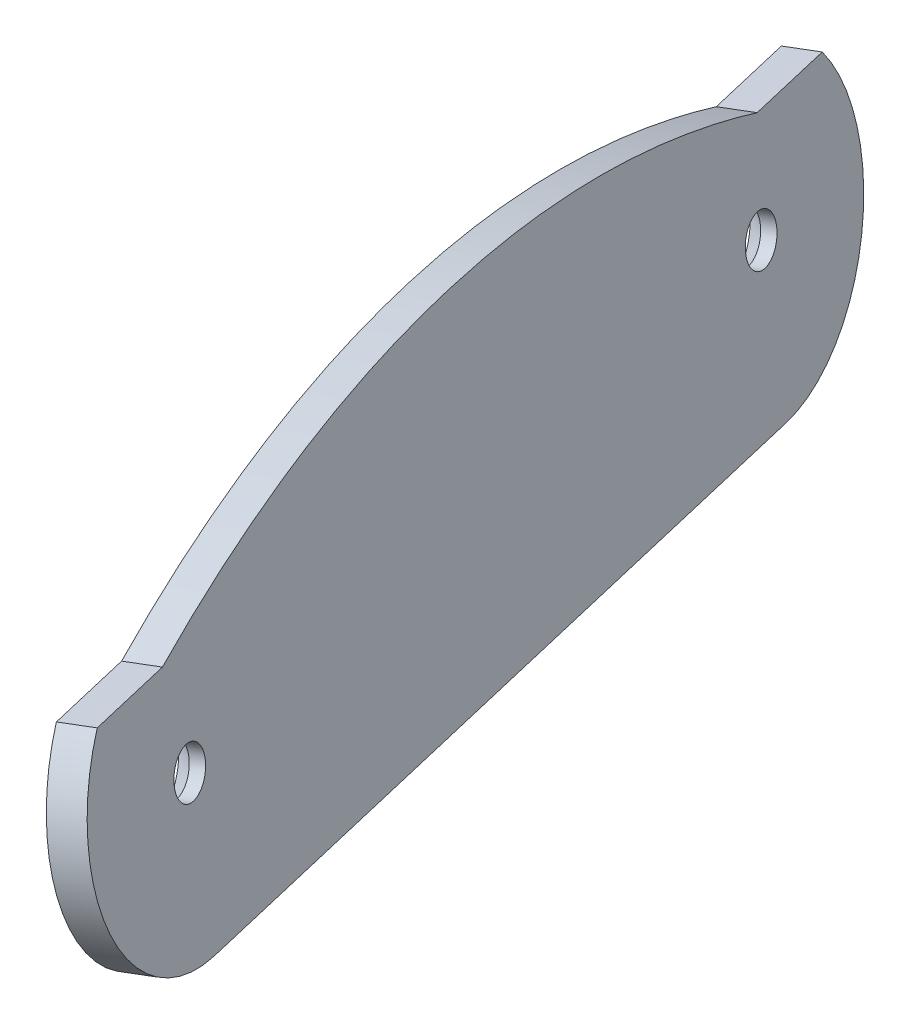
ISO-10303-21;
HEADER;
FILE_DESCRIPTION(('STEP AP214'),'2;1');
FILE_NAME('part.step','',(''),(''),'','','');
FILE_SCHEMA(('AUTOMOTIVE_DESIGN { 1 0 10303 214 1 1 1 1 }'));
ENDSEC;
DATA;
#1=APPLICATION_CONTEXT('core data for automotive mechanical design processes');
#2=APPLICATION_PROTOCOL_DEFINITION('international standard','automotive_design',2000,#1);
#3=PRODUCT_CONTEXT('',#1,'mechanical');
#4=PRODUCT('Part','Part','',(#3));
#5=PRODUCT_RELATED_PRODUCT_CATEGORY('part','',(#4));
#6=PRODUCT_DEFINITION_FORMATION('','',#4);
#7=PRODUCT_DEFINITION_CONTEXT('part definition',#1,'design');
#8=PRODUCT_DEFINITION('design','',#6,#7);
#9=PRODUCT_DEFINITION_SHAPE('','',#8);
#10=(LENGTH_UNIT() NAMED_UNIT(*) SI_UNIT(.MILLI.,.METRE.));
#11=(NAMED_UNIT(*) PLANE_ANGLE_UNIT() SI_UNIT($,.RADIAN.));
#12=(NAMED_UNIT(*) SI_UNIT($,.STERADIAN.) SOLID_ANGLE_UNIT());
#13=UNCERTAINTY_MEASURE_WITH_UNIT(LENGTH_MEASURE(1.E-05),#10,'distance_accuracy_value','');
#14=(GEOMETRIC_REPRESENTATION_CONTEXT(3) GLOBAL_UNCERTAINTY_ASSIGNED_CONTEXT((#13)) GLOBAL_UNIT_ASSIGNED_CONTEXT((#10,
#11,#12)) REPRESENTATION_CONTEXT('',''));
#15=CARTESIAN_POINT('',(0.,0.,0.));
#16=DIRECTION('',(0.,0.,1.));
#17=DIRECTION('',(1.,0.,0.));
#18=AXIS2_PLACEMENT_3D('',#15,#16,#17);
#19=CARTESIAN_POINT('',(-40.11295222287,17.0186543610889,-28.3343367908795));
#20=DIRECTION('',(-0.94260125672026,-0.173023358316314,0.285597248422197));
#21=DIRECTION('',(0.289970666872155,0.,0.957035533485418));
#22=AXIS2_PLACEMENT_3D('',#19,#20,#21);
#23=PLANE('',#22);
#24=CARTESIAN_POINT('',(-40.11295222287,17.0186543610889,-28.3343367908795));
#25=DIRECTION('',(0.94260125672026,0.173023358316314,-0.285597248422197));
#26=DIRECTION('',(-0.289970666872155,0.,-0.957035533485418));
#27=AXIS2_PLACEMENT_3D('',#24,#25,#26);
#28=CIRCLE('',#27,1.7);
#29=CARTESIAN_POINT('',(-40.6059023565526,17.0186543610889,-29.9612971978047));
#30=VERTEX_POINT('',#29);
#31=EDGE_CURVE('E241',#30,#30,#28,.F.);
#32=ORIENTED_EDGE('',*,*,#31,.T.);
#33=EDGE_LOOP('',(#32));
#34=FACE_BOUND('',#33,.T.);
#35=CARTESIAN_POINT('',(-22.579475875422,21.3484057293149,32.1572297687716));
#36=DIRECTION('',(0.94260125672026,0.173023358316314,-0.285597248422197));
#37=DIRECTION('',(-0.289970666872155,0.,-0.957035533485418));
#38=AXIS2_PLACEMENT_3D('',#35,#36,#37);
#39=CIRCLE('',#38,1.69999999999999);
#40=CARTESIAN_POINT('',(-23.0724260091046,21.3484057293149,30.5302693618464));
#41=VERTEX_POINT('',#40);
#42=EDGE_CURVE('E243',#41,#41,#39,.F.);
#43=ORIENTED_EDGE('',*,*,#42,.T.);
#44=EDGE_LOOP('',(#43));
#45=FACE_BOUND('',#44,.T.);
#46=CARTESIAN_POINT('',(-40.11295222287,17.0186543610889,-28.3343367908795));
#47=DIRECTION('',(-0.94260125672026,-0.173023358316314,0.285597248422197));
#48=DIRECTION('',(0.289970666872155,0.,0.957035533485418));
#49=AXIS2_PLACEMENT_3D('',#46,#47,#48);
#50=CIRCLE('',#49,11.0000000000005);
#51=CARTESIAN_POINT('',(-43.7672773970329,23.3143822759067,-36.5811372337226));
#52=VERTEX_POINT('',#51);
#53=CARTESIAN_POINT('',(-38.0737763440546,6.21085873277291,-28.1518117465194));
#54=VERTEX_POINT('',#53);
#55=EDGE_CURVE('E270',#52,#54,#50,.T.);
#56=ORIENTED_EDGE('',*,*,#55,.F.);
#57=DIRECTION('',(0.277735963345848,0.0685846687486946,0.958206072761484));
#58=VECTOR('',#57,1.);
#59=CARTESIAN_POINT('',(-32.6530255436484,26.0589576365155,1.76371192379228));
#60=LINE('',#59,#58);
#61=CARTESIAN_POINT('',(-41.7694932215581,23.8077190561194,-29.6886595511607));
#62=VERTEX_POINT('',#61);
#63=EDGE_CURVE('E135',#52,#62,#60,.T.);
#64=ORIENTED_EDGE('',*,*,#63,.T.);
#65=CARTESIAN_POINT('',(-23.0895950964223,27.9372593706154,34.4653282162256));
#66=CARTESIAN_POINT('',(-24.0435126727006,28.7861376137802,31.8312407173805));
#67=CARTESIAN_POINT('',(-25.9355283404896,30.2324582557961,26.4629498813215));
#68=CARTESIAN_POINT('',(-28.6732328036035,31.6082977859542,18.2608005105246));
#69=CARTESIAN_POINT('',(-31.2822930092692,32.1961759754505,10.0058653417986));
#70=CARTESIAN_POINT('',(-33.7685748223319,32.0018546785873,1.68227504790652));
#71=CARTESIAN_POINT('',(-36.1395781293714,31.0013702807458,-6.74924129429978));
#72=CARTESIAN_POINT('',(-38.3095526646606,29.2188320689078,-14.9910625469831));
#73=CARTESIAN_POINT('',(-40.2832311301018,26.687493899873,-23.0386626048435));
#74=CARTESIAN_POINT('',(-41.4733406747353,24.4748431444816,-28.3070572591958));
#75=CARTESIAN_POINT('',(-42.0290972035189,23.2502622065628,-30.8831952049758));
#76=B_SPLINE_CURVE_WITH_KNOTS('',3,(#65,#66,#67,#68,#69,#70,#71,#72,#73,#74,#75),.UNSPECIFIED.,
.F.,.F.,(4,1,1,1,1,1,1,1,4),(0.00843363175947347,0.131411631961573,0.254389632163673,
0.377367632365774,0.500345632567874,0.623323632769974,0.746301632972074,0.869279633174174,
0.992257633376274),.UNSPECIFIED.);
#77=CARTESIAN_POINT('',(-23.5218965035317,28.313816722725,33.2666659957263));
#78=VERTEX_POINT('',#77);
#79=EDGE_CURVE('E284',#78,#62,#76,.T.);
#80=ORIENTED_EDGE('',*,*,#79,.F.);
#81=DIRECTION('',(0.277735963345827,0.0685846687488062,0.958206072761482));
#82=VECTOR('',#81,1.);
#83=CARTESIAN_POINT('',(-23.5218965035314,28.3138167227251,33.2666659957262));
#84=LINE('',#83,#82);
#85=CARTESIAN_POINT('',(-21.5204654561153,28.8080540687172,40.1717256097006));
#86=VERTEX_POINT('',#85);
#87=EDGE_CURVE('E130',#78,#86,#84,.T.);
#88=ORIENTED_EDGE('',*,*,#87,.T.);
#89=CARTESIAN_POINT('',(-22.579475875422,21.3484057293149,32.1572297687716));
#90=DIRECTION('',(0.94260125672026,0.173023358316314,-0.285597248422197));
#91=DIRECTION('',(-0.289970666872155,0.,-0.957035533485418));
#92=AXIS2_PLACEMENT_3D('',#89,#90,#91);
#93=CIRCLE('',#92,11.0000000000006);
#94=CARTESIAN_POINT('',(-20.5402999966066,10.5406101009986,32.3397548131317));
#95=VERTEX_POINT('',#94);
#96=EDGE_CURVE('E277',#86,#95,#93,.T.);
#97=ORIENTED_EDGE('',*,*,#96,.T.);
#98=DIRECTION('',(0.277735963345854,0.0685846687486638,0.958206072761484));
#99=VECTOR('',#98,1.);
#100=CARTESIAN_POINT('',(-38.0737763440546,6.21085873277291,-28.1518117465194));
#101=LINE('',#100,#99);
#102=EDGE_CURVE('E273',#54,#95,#101,.T.);
#103=ORIENTED_EDGE('',*,*,#102,.F.);
#104=EDGE_LOOP('',(#56,#64,#80,#88,#97,#103));
#105=FACE_BOUND('',#104,.T.);
#106=ADVANCED_FACE('F93',(#34,#45,#105),#23,.F.);
#107=CARTESIAN_POINT('',(-42.4694553646706,16.5860959652982,-27.620343669824));
#108=DIRECTION('',(-0.94260125672026,-0.173023358316314,0.285597248422197));
#109=DIRECTION('',(0.289970666872155,0.,0.957035533485418));
#110=AXIS2_PLACEMENT_3D('',#107,#108,#109);
#111=PLANE('',#110);
#112=CARTESIAN_POINT('',(-24.9359790172226,20.9158473335241,32.8712228898271));
#113=DIRECTION('',(-0.94260125672026,-0.173023358316314,0.285597248422197));
#114=DIRECTION('',(0.289970666872155,0.,0.957035533485418));
#115=AXIS2_PLACEMENT_3D('',#112,#113,#114);
#116=CIRCLE('',#115,3.19999999999998);
#117=CARTESIAN_POINT('',(-24.0080728832317,20.9158473335241,35.9337365969804));
#118=VERTEX_POINT('',#117);
#119=EDGE_CURVE('E103',#118,#118,#116,.F.);
#120=ORIENTED_EDGE('',*,*,#119,.T.);
#121=EDGE_LOOP('',(#120));
#122=FACE_BOUND('',#121,.T.);
#123=CARTESIAN_POINT('',(-42.4694553646706,16.5860959652982,-27.620343669824));
#124=DIRECTION('',(-0.94260125672026,-0.173023358316314,0.285597248422197));
#125=DIRECTION('',(0.289970666872155,0.,0.957035533485418));
#126=AXIS2_PLACEMENT_3D('',#123,#124,#125);
#127=CIRCLE('',#126,3.2);
#128=CARTESIAN_POINT('',(-41.5415492306797,16.5860959652982,-24.5578299626707));
#129=VERTEX_POINT('',#128);
#130=EDGE_CURVE('E257',#129,#129,#127,.F.);
#131=ORIENTED_EDGE('',*,*,#130,.T.);
#132=EDGE_LOOP('',(#131));
#133=FACE_BOUND('',#132,.T.);
#134=CARTESIAN_POINT('',(-42.4694553646706,16.5860959652982,-27.620343669824));
#135=DIRECTION('',(-0.94260125672026,-0.173023358316314,0.285597248422197));
#136=DIRECTION('',(0.289970666872155,0.,0.957035533485418));
#137=AXIS2_PLACEMENT_3D('',#134,#135,#136);
#138=CIRCLE('',#137,11.0000000000005);
#139=CARTESIAN_POINT('',(-46.1237805388336,22.8818238801159,-35.8671441126671));
#140=VERTEX_POINT('',#139);
#141=CARTESIAN_POINT('',(-40.4302794858553,5.77830033698213,-27.4378186254639));
#142=VERTEX_POINT('',#141);
#143=EDGE_CURVE('E289',#140,#142,#138,.T.);
#144=ORIENTED_EDGE('',*,*,#143,.T.);
#145=DIRECTION('',(0.277735963345854,0.0685846687486638,0.958206072761484));
#146=VECTOR('',#145,1.);
#147=CARTESIAN_POINT('',(-40.4302794858553,5.77830033698213,-27.4378186254639));
#148=LINE('',#147,#146);
#149=CARTESIAN_POINT('',(-22.8968031384072,10.1080517052079,33.0537479341872));
#150=VERTEX_POINT('',#149);
#151=EDGE_CURVE('E143',#142,#150,#148,.T.);
#152=ORIENTED_EDGE('',*,*,#151,.T.);
#153=CARTESIAN_POINT('',(-24.9359790172226,20.9158473335241,32.8712228898271));
#154=DIRECTION('',(0.94260125672026,0.173023358316314,-0.285597248422197));
#155=DIRECTION('',(-0.289970666872155,0.,-0.957035533485418));
#156=AXIS2_PLACEMENT_3D('',#153,#154,#155);
#157=CIRCLE('',#156,11.0000000000006);
#158=CARTESIAN_POINT('',(-23.8769685979159,28.3754956729264,40.8857187307561));
#159=VERTEX_POINT('',#158);
#160=EDGE_CURVE('E177',#159,#150,#157,.T.);
#161=ORIENTED_EDGE('',*,*,#160,.F.);
#162=DIRECTION('',(0.277735963345827,0.0685846687488062,0.958206072761482));
#163=VECTOR('',#162,1.);
#164=CARTESIAN_POINT('',(-25.8783996453321,27.8812583269343,33.9806591167817));
#165=LINE('',#164,#163);
#166=CARTESIAN_POINT('',(-25.8783996453321,27.8812583269343,33.9806591167817));
#167=VERTEX_POINT('',#166);
#168=EDGE_CURVE('E159',#167,#159,#165,.T.);
#169=ORIENTED_EDGE('',*,*,#168,.F.);
#170=CARTESIAN_POINT('',(-25.4460982382229,27.5047009748246,35.1793213372811));
#171=CARTESIAN_POINT('',(-26.4000158145013,28.3535792179894,32.545233838436));
#172=CARTESIAN_POINT('',(-28.2920314822903,29.7998998600054,27.176943002377));
#173=CARTESIAN_POINT('',(-31.0297359454041,31.1757393901634,18.9747936315801));
#174=CARTESIAN_POINT('',(-33.6387961510699,31.7636175796597,10.7198584628541));
#175=CARTESIAN_POINT('',(-36.1250779641326,31.5692962827965,2.39626816896201));
#176=CARTESIAN_POINT('',(-38.496081271172,30.568811884955,-6.03524817324428));
#177=CARTESIAN_POINT('',(-40.6660558064612,28.786273673117,-14.2770694259276));
#178=CARTESIAN_POINT('',(-42.6397342719024,26.2549355040822,-22.324669483788));
#179=CARTESIAN_POINT('',(-43.8298438165359,24.0422847486908,-27.5930641381403));
#180=CARTESIAN_POINT('',(-44.3856003453195,22.817703810772,-30.1692020839203));
#181=B_SPLINE_CURVE_WITH_KNOTS('',3,(#170,#171,#172,#173,#174,#175,#176,#177,#178,#179,#180),
.UNSPECIFIED.,.F.,.F.,(4,1,1,1,1,1,1,1,4),(0.00843363175947347,0.131411631961573,
0.254389632163673,0.377367632365774,0.500345632567874,0.623323632769974,0.746301632972074,
0.869279633174174,0.992257633376274),.UNSPECIFIED.);
#182=CARTESIAN_POINT('',(-44.1259963633588,23.3751606603287,-28.9746664301028));
#183=VERTEX_POINT('',#182);
#184=EDGE_CURVE('E167',#167,#183,#181,.T.);
#185=ORIENTED_EDGE('',*,*,#184,.T.);
#186=DIRECTION('',(0.277735963345849,0.0685846687486948,0.958206072761483));
#187=VECTOR('',#186,1.);
#188=CARTESIAN_POINT('',(-46.1237805388336,22.8818238801159,-35.8671441126671));
#189=LINE('',#188,#187);
#190=EDGE_CURVE('E172',#140,#183,#189,.T.);
#191=ORIENTED_EDGE('',*,*,#190,.F.);
#192=EDGE_LOOP('',(#144,#152,#161,#169,#185,#191));
#193=FACE_BOUND('',#192,.T.);
#194=ADVANCED_FACE('F175',(#122,#133,#193),#111,.T.);
#195=CARTESIAN_POINT('',(-42.4694553646706,16.5860959652982,-27.620343669824));
#196=DIRECTION('',(0.94260125672026,0.173023358316314,-0.285597248422197));
#197=DIRECTION('',(-0.289970666872155,0.,-0.957035533485418));
#198=AXIS2_PLACEMENT_3D('',#195,#196,#197);
#199=CYLINDRICAL_SURFACE('',#198,11.0000000000005);
#200=ORIENTED_EDGE('',*,*,#55,.T.);
#201=DIRECTION('',(0.94260125672026,0.173023358316314,-0.285597248422197));
#202=VECTOR('',#201,1.);
#203=CARTESIAN_POINT('',(-40.4302794858553,5.77830033698213,-27.4378186254639));
#204=LINE('',#203,#202);
#205=EDGE_CURVE('E250',#142,#54,#204,.T.);
#206=ORIENTED_EDGE('',*,*,#205,.F.);
#207=ORIENTED_EDGE('',*,*,#143,.F.);
#208=DIRECTION('',(0.94260125672026,0.173023358316314,-0.285597248422197));
#209=VECTOR('',#208,1.);
#210=CARTESIAN_POINT('',(-46.1237805388336,22.8818238801159,-35.8671441126671));
#211=LINE('',#210,#209);
#212=EDGE_CURVE('E111',#140,#52,#211,.T.);
#213=ORIENTED_EDGE('',*,*,#212,.T.);
#214=EDGE_LOOP('',(#200,#206,#207,#213));
#215=FACE_BOUND('',#214,.T.);
#216=ADVANCED_FACE('F206',(#215),#199,.T.);
#217=CARTESIAN_POINT('',(-40.4302794858553,5.77830033698213,-27.4378186254639));
#218=DIRECTION('',(-0.185379625346845,0.982526875301424,-0.0165931858509169));
#219=DIRECTION('',(-0.982662164676656,-0.185405151257966,0.));
#220=AXIS2_PLACEMENT_3D('',#217,#218,#219);
#221=PLANE('',#220);
#222=ORIENTED_EDGE('',*,*,#102,.T.);
#223=DIRECTION('',(0.94260125672026,0.173023358316314,-0.285597248422197));
#224=VECTOR('',#223,1.);
#225=CARTESIAN_POINT('',(-22.8968031384072,10.1080517052079,33.0537479341872));
#226=LINE('',#225,#224);
#227=EDGE_CURVE('E299',#150,#95,#226,.T.);
#228=ORIENTED_EDGE('',*,*,#227,.F.);
#229=ORIENTED_EDGE('',*,*,#151,.F.);
#230=ORIENTED_EDGE('',*,*,#205,.T.);
#231=EDGE_LOOP('',(#222,#228,#229,#230));
#232=FACE_BOUND('',#231,.T.);
#233=ADVANCED_FACE('F202',(#232),#221,.F.);
#234=CARTESIAN_POINT('',(-24.9359790172226,20.9158473335241,32.8712228898271));
#235=DIRECTION('',(0.94260125672026,0.173023358316314,-0.285597248422197));
#236=DIRECTION('',(-0.289970666872155,0.,-0.957035533485418));
#237=AXIS2_PLACEMENT_3D('',#234,#235,#236);
#238=CYLINDRICAL_SURFACE('',#237,11.0000000000006);
#239=ORIENTED_EDGE('',*,*,#96,.F.);
#240=DIRECTION('',(0.94260125672026,0.173023358316314,-0.285597248422197));
#241=VECTOR('',#240,1.);
#242=CARTESIAN_POINT('',(-23.8769685979159,28.3754956729264,40.8857187307561));
#243=LINE('',#242,#241);
#244=EDGE_CURVE('E163',#159,#86,#243,.T.);
#245=ORIENTED_EDGE('',*,*,#244,.F.);
#246=ORIENTED_EDGE('',*,*,#160,.T.);
#247=ORIENTED_EDGE('',*,*,#227,.T.);
#248=EDGE_LOOP('',(#239,#245,#246,#247));
#249=FACE_BOUND('',#248,.T.);
#250=ADVANCED_FACE('F199',(#249),#238,.T.);
#251=CARTESIAN_POINT('',(-25.8783996453321,27.8812583269343,33.9806591167817));
#252=DIRECTION('',(-0.185379625346885,0.982526875301414,-0.0165931858510558));
#253=DIRECTION('',(-0.982662164676648,-0.185405151258007,0.));
#254=AXIS2_PLACEMENT_3D('',#251,#252,#253);
#255=PLANE('',#254);
#256=ORIENTED_EDGE('',*,*,#87,.F.);
#257=DIRECTION('',(0.94260125672026,0.173023358316314,-0.285597248422197));
#258=VECTOR('',#257,1.);
#259=CARTESIAN_POINT('',(-25.8783996453321,27.8812583269343,33.9806591167817));
#260=LINE('',#259,#258);
#261=EDGE_CURVE('E155',#167,#78,#260,.T.);
#262=ORIENTED_EDGE('',*,*,#261,.F.);
#263=ORIENTED_EDGE('',*,*,#168,.T.);
#264=ORIENTED_EDGE('',*,*,#244,.T.);
#265=EDGE_LOOP('',(#256,#262,#263,#264));
#266=FACE_BOUND('',#265,.T.);
#267=ADVANCED_FACE('F157',(#266),#255,.T.);
#268=DIRECTION('',(0.94260125672026,0.173023358316314,-0.285597248422197));
#269=VECTOR('',#268,1.);
#270=SURFACE_OF_LINEAR_EXTRUSION('',#181,#269);
#271=ORIENTED_EDGE('',*,*,#79,.T.);
#272=DIRECTION('',(0.94260125672026,0.173023358316314,-0.285597248422197));
#273=VECTOR('',#272,1.);
#274=CARTESIAN_POINT('',(-44.1259963633588,23.3751606603287,-28.9746664301028));
#275=LINE('',#274,#273);
#276=EDGE_CURVE('E164',#183,#62,#275,.T.);
#277=ORIENTED_EDGE('',*,*,#276,.F.);
#278=ORIENTED_EDGE('',*,*,#184,.F.);
#279=ORIENTED_EDGE('',*,*,#261,.T.);
#280=EDGE_LOOP('',(#271,#277,#278,#279));
#281=FACE_BOUND('',#280,.T.);
#282=ADVANCED_FACE('F168',(#281),#270,.F.);
#283=CARTESIAN_POINT('',(-46.1237805388336,22.8818238801159,-35.8671441126671));
#284=DIRECTION('',(-0.185379625346853,0.982526875301422,-0.016593185850947));
#285=DIRECTION('',(-0.982662164676654,-0.185405151257975,0.));
#286=AXIS2_PLACEMENT_3D('',#283,#284,#285);
#287=PLANE('',#286);
#288=ORIENTED_EDGE('',*,*,#63,.F.);
#289=ORIENTED_EDGE('',*,*,#212,.F.);
#290=ORIENTED_EDGE('',*,*,#190,.T.);
#291=ORIENTED_EDGE('',*,*,#276,.T.);
#292=EDGE_LOOP('',(#288,#289,#290,#291));
#293=FACE_BOUND('',#292,.T.);
#294=ADVANCED_FACE('F195',(#293),#287,.T.);
#295=CARTESIAN_POINT('',(-42.4694553646706,16.5860959652982,-27.620343669824));
#296=DIRECTION('',(0.94260125672026,0.173023358316314,-0.285597248422197));
#297=DIRECTION('',(-0.289970666872155,0.,-0.957035533485418));
#298=AXIS2_PLACEMENT_3D('',#295,#296,#297);
#299=CYLINDRICAL_SURFACE('',#298,1.7);
#300=CARTESIAN_POINT('',(-41.0555534795902,16.8456310027726,-28.0487395424573));
#301=DIRECTION('',(-0.942601256720261,-0.173023358316313,0.285597248422198));
#302=DIRECTION('',(0.289970666872155,0.,0.957035533485417));
#303=AXIS2_PLACEMENT_3D('',#300,#301,#302);
#304=CIRCLE('',#303,1.7);
#305=CARTESIAN_POINT('',(-40.5626033459076,16.8456310027726,-26.4217791355321));
#306=VERTEX_POINT('',#305);
#307=EDGE_CURVE('E12',#306,#306,#304,.T.);
#308=ORIENTED_EDGE('',*,*,#307,.T.);
#309=EDGE_LOOP('',(#308));
#310=FACE_BOUND('',#309,.T.);
#311=ORIENTED_EDGE('',*,*,#31,.F.);
#312=EDGE_LOOP('',(#311));
#313=FACE_BOUND('',#312,.T.);
#314=ADVANCED_FACE('F218',(#310,#313),#299,.F.);
#315=CARTESIAN_POINT('',(-24.9359790172226,20.9158473335241,32.8712228898271));
#316=DIRECTION('',(0.94260125672026,0.173023358316314,-0.285597248422197));
#317=DIRECTION('',(-0.289970666872155,0.,-0.957035533485418));
#318=AXIS2_PLACEMENT_3D('',#315,#316,#317);
#319=CYLINDRICAL_SURFACE('',#318,1.69999999999999);
#320=CARTESIAN_POINT('',(-23.5220771321422,21.1753823709986,32.4428270171938));
#321=DIRECTION('',(-0.942601256720261,-0.173023358316316,0.285597248422194));
#322=DIRECTION('',(0.289970666872151,0.,0.957035533485419));
#323=AXIS2_PLACEMENT_3D('',#320,#321,#322);
#324=CIRCLE('',#323,1.69999999999999);
#325=CARTESIAN_POINT('',(-23.0291269984596,21.1753823709986,34.069787424119));
#326=VERTEX_POINT('',#325);
#327=EDGE_CURVE('E247',#326,#326,#324,.T.);
#328=ORIENTED_EDGE('',*,*,#327,.T.);
#329=EDGE_LOOP('',(#328));
#330=FACE_BOUND('',#329,.T.);
#331=ORIENTED_EDGE('',*,*,#42,.F.);
#332=EDGE_LOOP('',(#331));
#333=FACE_BOUND('',#332,.T.);
#334=ADVANCED_FACE('F211',(#330,#333),#319,.F.);
#335=CARTESIAN_POINT('',(-23.5220771321422,21.1753823709986,32.4428270171938));
#336=DIRECTION('',(-0.942601256720261,-0.173023358316316,0.285597248422194));
#337=DIRECTION('',(0.289970666872151,0.,0.957035533485419));
#338=AXIS2_PLACEMENT_3D('',#335,#336,#337);
#339=CONICAL_SURFACE('',#338,1.69999999999999,0.785398163397449);
#340=ORIENTED_EDGE('',*,*,#119,.F.);
#341=EDGE_LOOP('',(#340));
#342=FACE_BOUND('',#341,.T.);
#343=ORIENTED_EDGE('',*,*,#327,.F.);
#344=EDGE_LOOP('',(#343));
#345=FACE_BOUND('',#344,.T.);
#346=ADVANCED_FACE('F209',(#342,#345),#339,.F.);
#347=CARTESIAN_POINT('',(-41.0555534795902,16.8456310027726,-28.0487395424573));
#348=DIRECTION('',(-0.942601256720261,-0.173023358316313,0.285597248422198));
#349=DIRECTION('',(0.289970666872155,0.,0.957035533485417));
#350=AXIS2_PLACEMENT_3D('',#347,#348,#349);
#351=CONICAL_SURFACE('',#350,1.7,0.785398163397448);
#352=ORIENTED_EDGE('',*,*,#130,.F.);
#353=EDGE_LOOP('',(#352));
#354=FACE_BOUND('',#353,.T.);
#355=ORIENTED_EDGE('',*,*,#307,.F.);
#356=EDGE_LOOP('',(#355));
#357=FACE_BOUND('',#356,.T.);
#358=ADVANCED_FACE('F95',(#354,#357),#351,.F.);
#359=CLOSED_SHELL('',(#106,#194,#216,#233,#250,#267,#282,#294,#314,#334,#346,#358));
#360=MANIFOLD_SOLID_BREP('B2',#359);
#361=ADVANCED_BREP_SHAPE_REPRESENTATION('',(#18,#360),#14);
#362=SHAPE_DEFINITION_REPRESENTATION(#9,#361);
ENDSEC;
END-ISO-10303-21;
